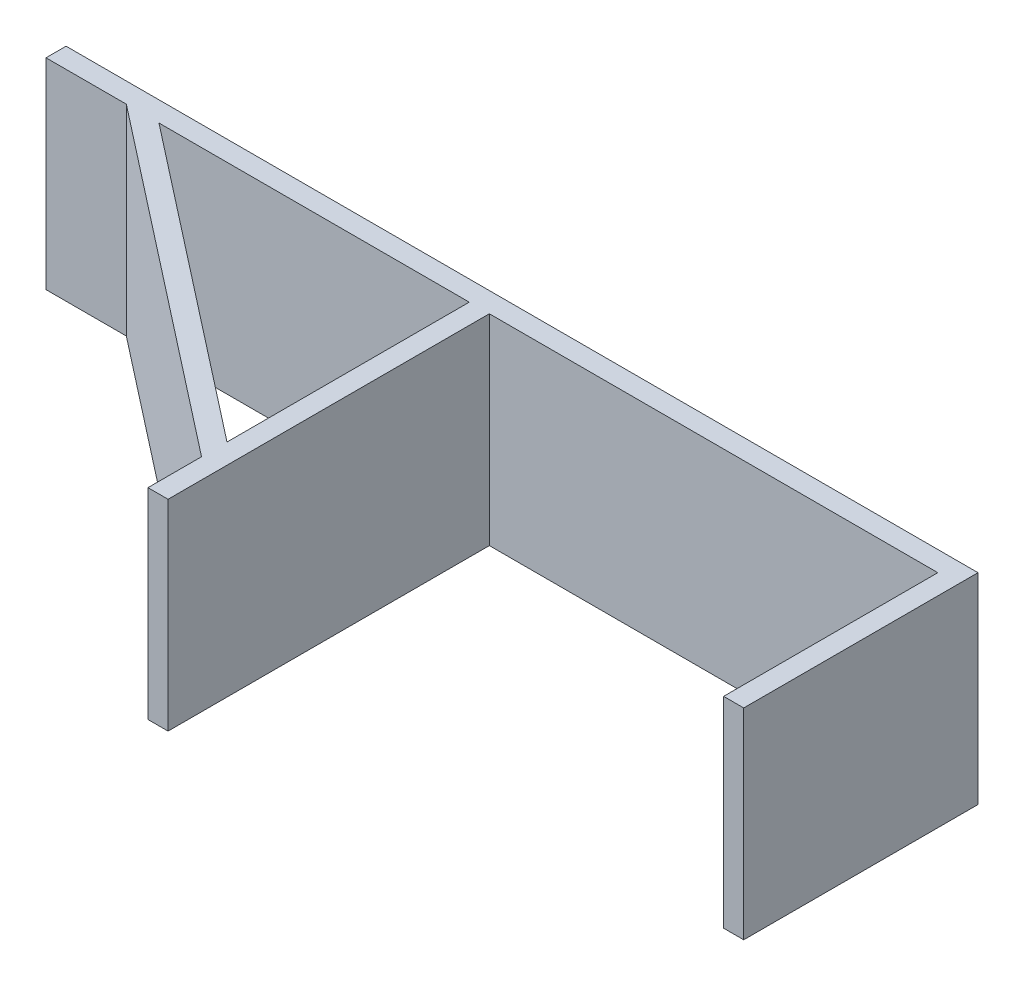
ISO-10303-21;
HEADER;
FILE_DESCRIPTION(('STEP AP214'),'2;1');
FILE_NAME('part.step','',(''),(''),'','','');
FILE_SCHEMA(('AUTOMOTIVE_DESIGN { 1 0 10303 214 1 1 1 1 }'));
ENDSEC;
DATA;
#1=APPLICATION_CONTEXT('core data for automotive mechanical design processes');
#2=APPLICATION_PROTOCOL_DEFINITION('international standard','automotive_design',2000,#1);
#3=PRODUCT_CONTEXT('',#1,'mechanical');
#4=PRODUCT('Part','Part','',(#3));
#5=PRODUCT_RELATED_PRODUCT_CATEGORY('part','',(#4));
#6=PRODUCT_DEFINITION_FORMATION('','',#4);
#7=PRODUCT_DEFINITION_CONTEXT('part definition',#1,'design');
#8=PRODUCT_DEFINITION('design','',#6,#7);
#9=PRODUCT_DEFINITION_SHAPE('','',#8);
#10=(LENGTH_UNIT() NAMED_UNIT(*) SI_UNIT(.MILLI.,.METRE.));
#11=(NAMED_UNIT(*) PLANE_ANGLE_UNIT() SI_UNIT($,.RADIAN.));
#12=(NAMED_UNIT(*) SI_UNIT($,.STERADIAN.) SOLID_ANGLE_UNIT());
#13=UNCERTAINTY_MEASURE_WITH_UNIT(LENGTH_MEASURE(1.E-05),#10,'distance_accuracy_value','');
#14=(GEOMETRIC_REPRESENTATION_CONTEXT(3) GLOBAL_UNCERTAINTY_ASSIGNED_CONTEXT((#13)) GLOBAL_UNIT_ASSIGNED_CONTEXT((#10,
#11,#12)) REPRESENTATION_CONTEXT('',''));
#15=CARTESIAN_POINT('',(0.,0.,0.));
#16=DIRECTION('',(0.,0.,1.));
#17=DIRECTION('',(1.,0.,0.));
#18=AXIS2_PLACEMENT_3D('',#15,#16,#17);
#19=CARTESIAN_POINT('',(68.5,40.,22.));
#20=DIRECTION('',(0.,0.,-1.));
#21=DIRECTION('',(-1.,0.,0.));
#22=AXIS2_PLACEMENT_3D('',#19,#20,#21);
#23=PLANE('',#22);
#24=DIRECTION('',(1.,0.,0.));
#25=VECTOR('',#24,1.);
#26=CARTESIAN_POINT('',(68.5,10.,22.));
#27=LINE('',#26,#25);
#28=CARTESIAN_POINT('',(68.5,10.,22.));
#29=VERTEX_POINT('',#28);
#30=CARTESIAN_POINT('',(71.5,10.,22.));
#31=VERTEX_POINT('',#30);
#32=EDGE_CURVE('E174',#29,#31,#27,.T.);
#33=ORIENTED_EDGE('',*,*,#32,.T.);
#34=DIRECTION('',(0.,-1.,0.));
#35=VECTOR('',#34,1.);
#36=CARTESIAN_POINT('',(71.5,40.,22.));
#37=LINE('',#36,#35);
#38=CARTESIAN_POINT('',(71.5,40.,22.));
#39=VERTEX_POINT('',#38);
#40=EDGE_CURVE('E11',#39,#31,#37,.T.);
#41=ORIENTED_EDGE('',*,*,#40,.F.);
#42=DIRECTION('',(1.,0.,0.));
#43=VECTOR('',#42,1.);
#44=CARTESIAN_POINT('',(68.5,40.,22.));
#45=LINE('',#44,#43);
#46=CARTESIAN_POINT('',(68.5,40.,22.));
#47=VERTEX_POINT('',#46);
#48=EDGE_CURVE('E177',#47,#39,#45,.T.);
#49=ORIENTED_EDGE('',*,*,#48,.F.);
#50=DIRECTION('',(0.,-1.,0.));
#51=VECTOR('',#50,1.);
#52=CARTESIAN_POINT('',(68.5,40.,22.));
#53=LINE('',#52,#51);
#54=EDGE_CURVE('E212',#47,#29,#53,.T.);
#55=ORIENTED_EDGE('',*,*,#54,.T.);
#56=EDGE_LOOP('',(#33,#41,#49,#55));
#57=FACE_BOUND('',#56,.T.);
#58=ADVANCED_FACE('F39',(#57),#23,.F.);
#59=CARTESIAN_POINT('',(71.5,40.,22.));
#60=DIRECTION('',(-1.,0.,0.));
#61=DIRECTION('',(0.,0.,1.));
#62=AXIS2_PLACEMENT_3D('',#59,#60,#61);
#63=PLANE('',#62);
#64=DIRECTION('',(0.,0.,-1.));
#65=VECTOR('',#64,1.);
#66=CARTESIAN_POINT('',(71.5,10.,22.));
#67=LINE('',#66,#65);
#68=CARTESIAN_POINT('',(71.5,10.,-13.));
#69=VERTEX_POINT('',#68);
#70=EDGE_CURVE('E216',#31,#69,#67,.T.);
#71=ORIENTED_EDGE('',*,*,#70,.T.);
#72=DIRECTION('',(0.,-1.,0.));
#73=VECTOR('',#72,1.);
#74=CARTESIAN_POINT('',(71.5,40.,-13.));
#75=LINE('',#74,#73);
#76=CARTESIAN_POINT('',(71.5,40.,-13.));
#77=VERTEX_POINT('',#76);
#78=EDGE_CURVE('E47',#77,#69,#75,.T.);
#79=ORIENTED_EDGE('',*,*,#78,.F.);
#80=DIRECTION('',(0.,0.,-1.));
#81=VECTOR('',#80,1.);
#82=CARTESIAN_POINT('',(71.5,40.,22.));
#83=LINE('',#82,#81);
#84=EDGE_CURVE('E181',#39,#77,#83,.T.);
#85=ORIENTED_EDGE('',*,*,#84,.F.);
#86=ORIENTED_EDGE('',*,*,#40,.T.);
#87=EDGE_LOOP('',(#71,#79,#85,#86));
#88=FACE_BOUND('',#87,.T.);
#89=ADVANCED_FACE('F306',(#88),#63,.F.);
#90=CARTESIAN_POINT('',(71.5,40.,-13.));
#91=DIRECTION('',(0.,0.,1.));
#92=DIRECTION('',(1.,0.,0.));
#93=AXIS2_PLACEMENT_3D('',#90,#91,#92);
#94=PLANE('',#93);
#95=DIRECTION('',(-1.,0.,0.));
#96=VECTOR('',#95,1.);
#97=CARTESIAN_POINT('',(71.5,10.,-13.));
#98=LINE('',#97,#96);
#99=CARTESIAN_POINT('',(-64.734753829798,10.,-13.));
#100=VERTEX_POINT('',#99);
#101=EDGE_CURVE('E219',#69,#100,#98,.T.);
#102=ORIENTED_EDGE('',*,*,#101,.T.);
#103=DIRECTION('',(0.,-1.,0.));
#104=VECTOR('',#103,1.);
#105=CARTESIAN_POINT('',(-64.734753829798,40.,-13.));
#106=LINE('',#105,#104);
#107=CARTESIAN_POINT('',(-64.734753829798,40.,-13.));
#108=VERTEX_POINT('',#107);
#109=EDGE_CURVE('E276',#108,#100,#106,.T.);
#110=ORIENTED_EDGE('',*,*,#109,.F.);
#111=DIRECTION('',(-1.,0.,0.));
#112=VECTOR('',#111,1.);
#113=CARTESIAN_POINT('',(71.5,40.,-13.));
#114=LINE('',#113,#112);
#115=EDGE_CURVE('E185',#77,#108,#114,.T.);
#116=ORIENTED_EDGE('',*,*,#115,.F.);
#117=ORIENTED_EDGE('',*,*,#78,.T.);
#118=EDGE_LOOP('',(#102,#110,#116,#117));
#119=FACE_BOUND('',#118,.T.);
#120=ADVANCED_FACE('F285',(#119),#94,.F.);
#121=CARTESIAN_POINT('',(-64.734753829798,40.,-13.));
#122=DIRECTION('',(1.,0.,0.));
#123=DIRECTION('',(0.,0.,-1.));
#124=AXIS2_PLACEMENT_3D('',#121,#122,#123);
#125=PLANE('',#124);
#126=DIRECTION('',(0.,0.,1.));
#127=VECTOR('',#126,1.);
#128=CARTESIAN_POINT('',(-64.734753829798,10.,-13.));
#129=LINE('',#128,#127);
#130=CARTESIAN_POINT('',(-64.734753829798,10.,-10.));
#131=VERTEX_POINT('',#130);
#132=EDGE_CURVE('E222',#100,#131,#129,.T.);
#133=ORIENTED_EDGE('',*,*,#132,.T.);
#134=DIRECTION('',(0.,-1.,0.));
#135=VECTOR('',#134,1.);
#136=CARTESIAN_POINT('',(-64.734753829798,40.,-10.));
#137=LINE('',#136,#135);
#138=CARTESIAN_POINT('',(-64.734753829798,40.,-10.));
#139=VERTEX_POINT('',#138);
#140=EDGE_CURVE('E272',#139,#131,#137,.T.);
#141=ORIENTED_EDGE('',*,*,#140,.F.);
#142=DIRECTION('',(0.,0.,1.));
#143=VECTOR('',#142,1.);
#144=CARTESIAN_POINT('',(-64.734753829798,40.,-13.));
#145=LINE('',#144,#143);
#146=EDGE_CURVE('E188',#108,#139,#145,.T.);
#147=ORIENTED_EDGE('',*,*,#146,.F.);
#148=ORIENTED_EDGE('',*,*,#109,.T.);
#149=EDGE_LOOP('',(#133,#141,#147,#148));
#150=FACE_BOUND('',#149,.T.);
#151=ADVANCED_FACE('F296',(#150),#125,.F.);
#152=CARTESIAN_POINT('',(-64.734753829798,40.,-10.));
#153=DIRECTION('',(0.,0.,-1.));
#154=DIRECTION('',(-1.,0.,0.));
#155=AXIS2_PLACEMENT_3D('',#152,#153,#154);
#156=PLANE('',#155);
#157=DIRECTION('',(1.,0.,0.));
#158=VECTOR('',#157,1.);
#159=CARTESIAN_POINT('',(-64.734753829798,10.,-10.));
#160=LINE('',#159,#158);
#161=CARTESIAN_POINT('',(-52.734753829798,10.,-9.99999999999999));
#162=VERTEX_POINT('',#161);
#163=EDGE_CURVE('E225',#131,#162,#160,.T.);
#164=ORIENTED_EDGE('',*,*,#163,.T.);
#165=DIRECTION('',(0.,-1.,0.));
#166=VECTOR('',#165,1.);
#167=CARTESIAN_POINT('',(-52.734753829798,40.,-9.99999999999999));
#168=LINE('',#167,#166);
#169=CARTESIAN_POINT('',(-52.734753829798,40.,-9.99999999999999));
#170=VERTEX_POINT('',#169);
#171=EDGE_CURVE('E268',#170,#162,#168,.T.);
#172=ORIENTED_EDGE('',*,*,#171,.F.);
#173=DIRECTION('',(1.,0.,0.));
#174=VECTOR('',#173,1.);
#175=CARTESIAN_POINT('',(-64.734753829798,40.,-10.));
#176=LINE('',#175,#174);
#177=EDGE_CURVE('E191',#139,#170,#176,.T.);
#178=ORIENTED_EDGE('',*,*,#177,.F.);
#179=ORIENTED_EDGE('',*,*,#140,.T.);
#180=EDGE_LOOP('',(#164,#172,#178,#179));
#181=FACE_BOUND('',#180,.T.);
#182=ADVANCED_FACE('F300',(#181),#156,.F.);
#183=CARTESIAN_POINT('',(-52.734753829798,40.,-9.99999999999999));
#184=DIRECTION('',(0.615384615384616,0.,-0.788226981996892));
#185=DIRECTION('',(-0.788226981996892,0.,-0.615384615384616));
#186=AXIS2_PLACEMENT_3D('',#183,#184,#185);
#187=PLANE('',#186);
#188=DIRECTION('',(0.788226981996892,0.,0.615384615384615));
#189=VECTOR('',#188,1.);
#190=CARTESIAN_POINT('',(-52.734753829798,10.,-9.99999999999999));
#191=LINE('',#190,#189);
#192=CARTESIAN_POINT('',(-1.5,10.,30.));
#193=VERTEX_POINT('',#192);
#194=EDGE_CURVE('E228',#162,#193,#191,.T.);
#195=ORIENTED_EDGE('',*,*,#194,.T.);
#196=DIRECTION('',(0.,-1.,0.));
#197=VECTOR('',#196,1.);
#198=CARTESIAN_POINT('',(-1.5,40.,30.));
#199=LINE('',#198,#197);
#200=CARTESIAN_POINT('',(-1.5,40.,30.));
#201=VERTEX_POINT('',#200);
#202=EDGE_CURVE('E264',#201,#193,#199,.T.);
#203=ORIENTED_EDGE('',*,*,#202,.F.);
#204=DIRECTION('',(0.788226981996892,0.,0.615384615384615));
#205=VECTOR('',#204,1.);
#206=CARTESIAN_POINT('',(-52.734753829798,40.,-9.99999999999999));
#207=LINE('',#206,#205);
#208=EDGE_CURVE('E194',#170,#201,#207,.T.);
#209=ORIENTED_EDGE('',*,*,#208,.F.);
#210=ORIENTED_EDGE('',*,*,#171,.T.);
#211=EDGE_LOOP('',(#195,#203,#209,#210));
#212=FACE_BOUND('',#211,.T.);
#213=ADVANCED_FACE('F334',(#212),#187,.F.);
#214=CARTESIAN_POINT('',(-1.5,40.,30.));
#215=DIRECTION('',(1.,0.,0.));
#216=DIRECTION('',(0.,0.,-1.));
#217=AXIS2_PLACEMENT_3D('',#214,#215,#216);
#218=PLANE('',#217);
#219=DIRECTION('',(0.,0.,1.));
#220=VECTOR('',#219,1.);
#221=CARTESIAN_POINT('',(-1.5,10.,30.));
#222=LINE('',#221,#220);
#223=CARTESIAN_POINT('',(-1.5,10.,38.));
#224=VERTEX_POINT('',#223);
#225=EDGE_CURVE('E231',#193,#224,#222,.T.);
#226=ORIENTED_EDGE('',*,*,#225,.T.);
#227=DIRECTION('',(0.,-1.,0.));
#228=VECTOR('',#227,1.);
#229=CARTESIAN_POINT('',(-1.5,40.,38.));
#230=LINE('',#229,#228);
#231=CARTESIAN_POINT('',(-1.5,40.,38.));
#232=VERTEX_POINT('',#231);
#233=EDGE_CURVE('E260',#232,#224,#230,.T.);
#234=ORIENTED_EDGE('',*,*,#233,.F.);
#235=DIRECTION('',(0.,0.,1.));
#236=VECTOR('',#235,1.);
#237=CARTESIAN_POINT('',(-1.5,40.,30.));
#238=LINE('',#237,#236);
#239=EDGE_CURVE('E197',#201,#232,#238,.T.);
#240=ORIENTED_EDGE('',*,*,#239,.F.);
#241=ORIENTED_EDGE('',*,*,#202,.T.);
#242=EDGE_LOOP('',(#226,#234,#240,#241));
#243=FACE_BOUND('',#242,.T.);
#244=ADVANCED_FACE('F332',(#243),#218,.F.);
#245=CARTESIAN_POINT('',(-1.5,40.,38.));
#246=DIRECTION('',(0.,0.,-1.));
#247=DIRECTION('',(-1.,0.,0.));
#248=AXIS2_PLACEMENT_3D('',#245,#246,#247);
#249=PLANE('',#248);
#250=DIRECTION('',(1.,0.,0.));
#251=VECTOR('',#250,1.);
#252=CARTESIAN_POINT('',(-1.5,10.,38.));
#253=LINE('',#252,#251);
#254=CARTESIAN_POINT('',(1.5,10.,38.));
#255=VERTEX_POINT('',#254);
#256=EDGE_CURVE('E234',#224,#255,#253,.T.);
#257=ORIENTED_EDGE('',*,*,#256,.T.);
#258=DIRECTION('',(0.,-1.,0.));
#259=VECTOR('',#258,1.);
#260=CARTESIAN_POINT('',(1.5,40.,38.));
#261=LINE('',#260,#259);
#262=CARTESIAN_POINT('',(1.5,40.,38.));
#263=VERTEX_POINT('',#262);
#264=EDGE_CURVE('E256',#263,#255,#261,.T.);
#265=ORIENTED_EDGE('',*,*,#264,.F.);
#266=DIRECTION('',(1.,0.,0.));
#267=VECTOR('',#266,1.);
#268=CARTESIAN_POINT('',(-1.5,40.,38.));
#269=LINE('',#268,#267);
#270=EDGE_CURVE('E200',#232,#263,#269,.T.);
#271=ORIENTED_EDGE('',*,*,#270,.F.);
#272=ORIENTED_EDGE('',*,*,#233,.T.);
#273=EDGE_LOOP('',(#257,#265,#271,#272));
#274=FACE_BOUND('',#273,.T.);
#275=ADVANCED_FACE('F327',(#274),#249,.F.);
#276=CARTESIAN_POINT('',(1.5,40.,38.));
#277=DIRECTION('',(-1.,0.,0.));
#278=DIRECTION('',(0.,0.,1.));
#279=AXIS2_PLACEMENT_3D('',#276,#277,#278);
#280=PLANE('',#279);
#281=DIRECTION('',(0.,0.,-1.));
#282=VECTOR('',#281,1.);
#283=CARTESIAN_POINT('',(1.5,10.,38.));
#284=LINE('',#283,#282);
#285=CARTESIAN_POINT('',(1.5,10.,-10.));
#286=VERTEX_POINT('',#285);
#287=EDGE_CURVE('E237',#255,#286,#284,.T.);
#288=ORIENTED_EDGE('',*,*,#287,.T.);
#289=DIRECTION('',(0.,-1.,0.));
#290=VECTOR('',#289,1.);
#291=CARTESIAN_POINT('',(1.5,40.,-10.));
#292=LINE('',#291,#290);
#293=CARTESIAN_POINT('',(1.5,40.,-10.));
#294=VERTEX_POINT('',#293);
#295=EDGE_CURVE('E252',#294,#286,#292,.T.);
#296=ORIENTED_EDGE('',*,*,#295,.F.);
#297=DIRECTION('',(0.,0.,-1.));
#298=VECTOR('',#297,1.);
#299=CARTESIAN_POINT('',(1.5,40.,38.));
#300=LINE('',#299,#298);
#301=EDGE_CURVE('E203',#263,#294,#300,.T.);
#302=ORIENTED_EDGE('',*,*,#301,.F.);
#303=ORIENTED_EDGE('',*,*,#264,.T.);
#304=EDGE_LOOP('',(#288,#296,#302,#303));
#305=FACE_BOUND('',#304,.T.);
#306=ADVANCED_FACE('F322',(#305),#280,.F.);
#307=CARTESIAN_POINT('',(1.5,40.,-10.));
#308=DIRECTION('',(0.,0.,-1.));
#309=DIRECTION('',(-1.,0.,0.));
#310=AXIS2_PLACEMENT_3D('',#307,#308,#309);
#311=PLANE('',#310);
#312=DIRECTION('',(1.,0.,0.));
#313=VECTOR('',#312,1.);
#314=CARTESIAN_POINT('',(1.5,10.,-10.));
#315=LINE('',#314,#313);
#316=CARTESIAN_POINT('',(68.5,10.,-10.));
#317=VERTEX_POINT('',#316);
#318=EDGE_CURVE('E240',#286,#317,#315,.T.);
#319=ORIENTED_EDGE('',*,*,#318,.T.);
#320=DIRECTION('',(0.,-1.,0.));
#321=VECTOR('',#320,1.);
#322=CARTESIAN_POINT('',(68.5,40.,-10.));
#323=LINE('',#322,#321);
#324=CARTESIAN_POINT('',(68.5,40.,-10.));
#325=VERTEX_POINT('',#324);
#326=EDGE_CURVE('E248',#325,#317,#323,.T.);
#327=ORIENTED_EDGE('',*,*,#326,.F.);
#328=DIRECTION('',(1.,0.,0.));
#329=VECTOR('',#328,1.);
#330=CARTESIAN_POINT('',(1.5,40.,-10.));
#331=LINE('',#330,#329);
#332=EDGE_CURVE('E206',#294,#325,#331,.T.);
#333=ORIENTED_EDGE('',*,*,#332,.F.);
#334=ORIENTED_EDGE('',*,*,#295,.T.);
#335=EDGE_LOOP('',(#319,#327,#333,#334));
#336=FACE_BOUND('',#335,.T.);
#337=ADVANCED_FACE('F318',(#336),#311,.F.);
#338=CARTESIAN_POINT('',(68.5,40.,-10.));
#339=DIRECTION('',(1.,0.,0.));
#340=DIRECTION('',(0.,0.,-1.));
#341=AXIS2_PLACEMENT_3D('',#338,#339,#340);
#342=PLANE('',#341);
#343=DIRECTION('',(0.,0.,1.));
#344=VECTOR('',#343,1.);
#345=CARTESIAN_POINT('',(68.5,10.,-10.));
#346=LINE('',#345,#344);
#347=EDGE_CURVE('E182',#317,#29,#346,.T.);
#348=ORIENTED_EDGE('',*,*,#347,.T.);
#349=ORIENTED_EDGE('',*,*,#54,.F.);
#350=DIRECTION('',(0.,0.,1.));
#351=VECTOR('',#350,1.);
#352=CARTESIAN_POINT('',(68.5,40.,-10.));
#353=LINE('',#352,#351);
#354=EDGE_CURVE('E209',#325,#47,#353,.T.);
#355=ORIENTED_EDGE('',*,*,#354,.F.);
#356=ORIENTED_EDGE('',*,*,#326,.T.);
#357=EDGE_LOOP('',(#348,#349,#355,#356));
#358=FACE_BOUND('',#357,.T.);
#359=ADVANCED_FACE('F313',(#358),#342,.F.);
#360=CARTESIAN_POINT('',(0.,40.,0.));
#361=DIRECTION('',(0.,1.,0.));
#362=DIRECTION('',(0.,0.,1.));
#363=AXIS2_PLACEMENT_3D('',#360,#361,#362);
#364=PLANE('',#363);
#365=DIRECTION('',(1.,0.,0.));
#366=VECTOR('',#365,1.);
#367=CARTESIAN_POINT('',(-1.49999999999999,40.,-10.));
#368=LINE('',#367,#366);
#369=CARTESIAN_POINT('',(-47.859753829798,40.,-10.));
#370=VERTEX_POINT('',#369);
#371=CARTESIAN_POINT('',(-1.49999999999999,40.,-10.));
#372=VERTEX_POINT('',#371);
#373=EDGE_CURVE('E142',#370,#372,#368,.T.);
#374=ORIENTED_EDGE('',*,*,#373,.T.);
#375=DIRECTION('',(0.,0.,1.));
#376=VECTOR('',#375,1.);
#377=CARTESIAN_POINT('',(-1.5,40.,26.1939897155007));
#378=LINE('',#377,#376);
#379=CARTESIAN_POINT('',(-1.5,40.,26.1939897155007));
#380=VERTEX_POINT('',#379);
#381=EDGE_CURVE('E150',#372,#380,#378,.T.);
#382=ORIENTED_EDGE('',*,*,#381,.T.);
#383=DIRECTION('',(-0.788226981996892,0.,-0.615384615384615));
#384=VECTOR('',#383,1.);
#385=CARTESIAN_POINT('',(-47.859753829798,40.,-10.));
#386=LINE('',#385,#384);
#387=EDGE_CURVE('E54',#380,#370,#386,.T.);
#388=ORIENTED_EDGE('',*,*,#387,.T.);
#389=EDGE_LOOP('',(#374,#382,#388));
#390=FACE_BOUND('',#389,.T.);
#391=ORIENTED_EDGE('',*,*,#48,.T.);
#392=ORIENTED_EDGE('',*,*,#84,.T.);
#393=ORIENTED_EDGE('',*,*,#115,.T.);
#394=ORIENTED_EDGE('',*,*,#146,.T.);
#395=ORIENTED_EDGE('',*,*,#177,.T.);
#396=ORIENTED_EDGE('',*,*,#208,.T.);
#397=ORIENTED_EDGE('',*,*,#239,.T.);
#398=ORIENTED_EDGE('',*,*,#270,.T.);
#399=ORIENTED_EDGE('',*,*,#301,.T.);
#400=ORIENTED_EDGE('',*,*,#332,.T.);
#401=ORIENTED_EDGE('',*,*,#354,.T.);
#402=EDGE_LOOP('',(#391,#392,#393,#394,#395,#396,#397,#398,#399,#400,#401));
#403=FACE_BOUND('',#402,.T.);
#404=ADVANCED_FACE('F155',(#390,#403),#364,.T.);
#405=CARTESIAN_POINT('',(0.,10.,0.));
#406=DIRECTION('',(0.,1.,0.));
#407=DIRECTION('',(0.,0.,1.));
#408=AXIS2_PLACEMENT_3D('',#405,#406,#407);
#409=PLANE('',#408);
#410=DIRECTION('',(0.,0.,1.));
#411=VECTOR('',#410,1.);
#412=CARTESIAN_POINT('',(-1.5,10.,26.1939897155007));
#413=LINE('',#412,#411);
#414=CARTESIAN_POINT('',(-1.49999999999999,10.,-10.));
#415=VERTEX_POINT('',#414);
#416=CARTESIAN_POINT('',(-1.5,10.,26.1939897155007));
#417=VERTEX_POINT('',#416);
#418=EDGE_CURVE('E162',#415,#417,#413,.T.);
#419=ORIENTED_EDGE('',*,*,#418,.F.);
#420=DIRECTION('',(1.,0.,0.));
#421=VECTOR('',#420,1.);
#422=CARTESIAN_POINT('',(-1.49999999999999,10.,-10.));
#423=LINE('',#422,#421);
#424=CARTESIAN_POINT('',(-47.859753829798,10.,-10.));
#425=VERTEX_POINT('',#424);
#426=EDGE_CURVE('E62',#425,#415,#423,.T.);
#427=ORIENTED_EDGE('',*,*,#426,.F.);
#428=DIRECTION('',(-0.788226981996892,0.,-0.615384615384615));
#429=VECTOR('',#428,1.);
#430=CARTESIAN_POINT('',(-47.859753829798,10.,-10.));
#431=LINE('',#430,#429);
#432=EDGE_CURVE('E158',#417,#425,#431,.T.);
#433=ORIENTED_EDGE('',*,*,#432,.F.);
#434=EDGE_LOOP('',(#419,#427,#433));
#435=FACE_BOUND('',#434,.T.);
#436=ORIENTED_EDGE('',*,*,#32,.F.);
#437=ORIENTED_EDGE('',*,*,#347,.F.);
#438=ORIENTED_EDGE('',*,*,#318,.F.);
#439=ORIENTED_EDGE('',*,*,#287,.F.);
#440=ORIENTED_EDGE('',*,*,#256,.F.);
#441=ORIENTED_EDGE('',*,*,#225,.F.);
#442=ORIENTED_EDGE('',*,*,#194,.F.);
#443=ORIENTED_EDGE('',*,*,#163,.F.);
#444=ORIENTED_EDGE('',*,*,#132,.F.);
#445=ORIENTED_EDGE('',*,*,#101,.F.);
#446=ORIENTED_EDGE('',*,*,#70,.F.);
#447=EDGE_LOOP('',(#436,#437,#438,#439,#440,#441,#442,#443,#444,#445,#446));
#448=FACE_BOUND('',#447,.T.);
#449=ADVANCED_FACE('F291',(#435,#448),#409,.F.);
#450=CARTESIAN_POINT('',(-1.49999999999999,40.,-10.));
#451=DIRECTION('',(0.,0.,-1.));
#452=DIRECTION('',(-1.,0.,0.));
#453=AXIS2_PLACEMENT_3D('',#450,#451,#452);
#454=PLANE('',#453);
#455=ORIENTED_EDGE('',*,*,#426,.T.);
#456=DIRECTION('',(0.,-1.,0.));
#457=VECTOR('',#456,1.);
#458=CARTESIAN_POINT('',(-1.49999999999999,40.,-10.));
#459=LINE('',#458,#457);
#460=EDGE_CURVE('E138',#372,#415,#459,.T.);
#461=ORIENTED_EDGE('',*,*,#460,.F.);
#462=ORIENTED_EDGE('',*,*,#373,.F.);
#463=DIRECTION('',(0.,-1.,0.));
#464=VECTOR('',#463,1.);
#465=CARTESIAN_POINT('',(-47.859753829798,40.,-10.));
#466=LINE('',#465,#464);
#467=EDGE_CURVE('E171',#370,#425,#466,.T.);
#468=ORIENTED_EDGE('',*,*,#467,.T.);
#469=EDGE_LOOP('',(#455,#461,#462,#468));
#470=FACE_BOUND('',#469,.T.);
#471=ADVANCED_FACE('F140',(#470),#454,.F.);
#472=CARTESIAN_POINT('',(-47.859753829798,40.,-10.));
#473=DIRECTION('',(-0.615384615384615,0.,0.788226981996892));
#474=DIRECTION('',(0.788226981996892,0.,0.615384615384615));
#475=AXIS2_PLACEMENT_3D('',#472,#473,#474);
#476=PLANE('',#475);
#477=ORIENTED_EDGE('',*,*,#432,.T.);
#478=ORIENTED_EDGE('',*,*,#467,.F.);
#479=ORIENTED_EDGE('',*,*,#387,.F.);
#480=DIRECTION('',(0.,-1.,0.));
#481=VECTOR('',#480,1.);
#482=CARTESIAN_POINT('',(-1.5,40.,26.1939897155007));
#483=LINE('',#482,#481);
#484=EDGE_CURVE('E147',#380,#417,#483,.T.);
#485=ORIENTED_EDGE('',*,*,#484,.T.);
#486=EDGE_LOOP('',(#477,#478,#479,#485));
#487=FACE_BOUND('',#486,.T.);
#488=ADVANCED_FACE('F429',(#487),#476,.F.);
#489=CARTESIAN_POINT('',(-1.5,40.,26.1939897155007));
#490=DIRECTION('',(1.,0.,0.));
#491=DIRECTION('',(0.,0.,-1.));
#492=AXIS2_PLACEMENT_3D('',#489,#490,#491);
#493=PLANE('',#492);
#494=ORIENTED_EDGE('',*,*,#418,.T.);
#495=ORIENTED_EDGE('',*,*,#484,.F.);
#496=ORIENTED_EDGE('',*,*,#381,.F.);
#497=ORIENTED_EDGE('',*,*,#460,.T.);
#498=EDGE_LOOP('',(#494,#495,#496,#497));
#499=FACE_BOUND('',#498,.T.);
#500=ADVANCED_FACE('F151',(#499),#493,.F.);
#501=CLOSED_SHELL('',(#58,#89,#120,#151,#182,#213,#244,#275,#306,#337,#359,#404,#449,#471,#488,#500));
#502=MANIFOLD_SOLID_BREP('B2',#501);
#503=ADVANCED_BREP_SHAPE_REPRESENTATION('',(#18,#502),#14);
#504=SHAPE_DEFINITION_REPRESENTATION(#9,#503);
ENDSEC;
END-ISO-10303-21;
